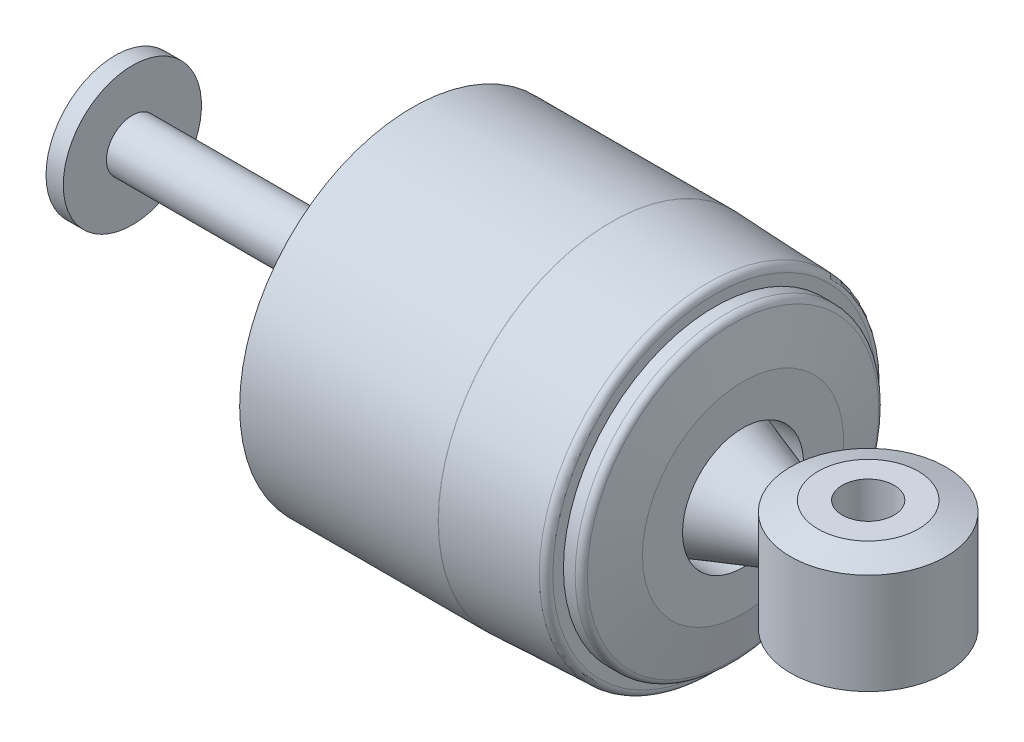
ISO-10303-21;
HEADER;
FILE_DESCRIPTION(('STEP AP214'),'2;1');
FILE_NAME('part.step','',(''),(''),'','','');
FILE_SCHEMA(('AUTOMOTIVE_DESIGN { 1 0 10303 214 1 1 1 1 }'));
ENDSEC;
DATA;
#1=APPLICATION_CONTEXT('core data for automotive mechanical design processes');
#2=APPLICATION_PROTOCOL_DEFINITION('international standard','automotive_design',2000,#1);
#3=PRODUCT_CONTEXT('',#1,'mechanical');
#4=PRODUCT('Part','Part','',(#3));
#5=PRODUCT_RELATED_PRODUCT_CATEGORY('part','',(#4));
#6=PRODUCT_DEFINITION_FORMATION('','',#4);
#7=PRODUCT_DEFINITION_CONTEXT('part definition',#1,'design');
#8=PRODUCT_DEFINITION('design','',#6,#7);
#9=PRODUCT_DEFINITION_SHAPE('','',#8);
#10=(LENGTH_UNIT() NAMED_UNIT(*) SI_UNIT(.MILLI.,.METRE.));
#11=(NAMED_UNIT(*) PLANE_ANGLE_UNIT() SI_UNIT($,.RADIAN.));
#12=(NAMED_UNIT(*) SI_UNIT($,.STERADIAN.) SOLID_ANGLE_UNIT());
#13=UNCERTAINTY_MEASURE_WITH_UNIT(LENGTH_MEASURE(1.E-05),#10,'distance_accuracy_value','');
#14=(GEOMETRIC_REPRESENTATION_CONTEXT(3) GLOBAL_UNCERTAINTY_ASSIGNED_CONTEXT((#13)) GLOBAL_UNIT_ASSIGNED_CONTEXT((#10,
#11,#12)) REPRESENTATION_CONTEXT('',''));
#15=CARTESIAN_POINT('',(0.,0.,0.));
#16=DIRECTION('',(0.,0.,1.));
#17=DIRECTION('',(1.,0.,0.));
#18=AXIS2_PLACEMENT_3D('',#15,#16,#17);
#19=CARTESIAN_POINT('',(70.4227238419156,11.1125,-7.51423949772597));
#20=DIRECTION('',(0.,1.,0.));
#21=DIRECTION('',(0.,0.,1.));
#22=AXIS2_PLACEMENT_3D('',#19,#20,#21);
#23=PLANE('',#22);
#24=CARTESIAN_POINT('',(70.4227238419156,11.1125,-7.51423949772597));
#25=DIRECTION('',(0.,1.,0.));
#26=DIRECTION('',(0.,0.,1.));
#27=AXIS2_PLACEMENT_3D('',#24,#25,#26);
#28=CIRCLE('',#27,9.20749999999995);
#29=CARTESIAN_POINT('',(70.4227238419156,11.1125,-16.7217394977259));
#30=VERTEX_POINT('',#29);
#31=EDGE_CURVE('E11',#30,#30,#28,.T.);
#32=ORIENTED_EDGE('',*,*,#31,.T.);
#33=EDGE_LOOP('',(#32));
#34=FACE_BOUND('',#33,.T.);
#35=CARTESIAN_POINT('',(70.4227238419156,11.1125,-7.51423949772597));
#36=DIRECTION('',(0.,1.,0.));
#37=DIRECTION('',(0.,0.,1.));
#38=AXIS2_PLACEMENT_3D('',#35,#36,#37);
#39=CIRCLE('',#38,4.7625);
#40=CARTESIAN_POINT('',(70.4227238419156,11.1125,-2.75173949772597));
#41=VERTEX_POINT('',#40);
#42=EDGE_CURVE('E62',#41,#41,#39,.T.);
#43=ORIENTED_EDGE('',*,*,#42,.F.);
#44=EDGE_LOOP('',(#43));
#45=FACE_BOUND('',#44,.T.);
#46=ADVANCED_FACE('F42',(#34,#45),#23,.T.);
#47=CARTESIAN_POINT('',(70.4227238419156,-11.1125,-7.51423949772596));
#48=DIRECTION('',(0.,1.,0.));
#49=DIRECTION('',(0.,0.,1.));
#50=AXIS2_PLACEMENT_3D('',#47,#48,#49);
#51=PLANE('',#50);
#52=CARTESIAN_POINT('',(70.4227238419156,-11.1125,-7.51423949772596));
#53=DIRECTION('',(0.,1.,0.));
#54=DIRECTION('',(0.,0.,1.));
#55=AXIS2_PLACEMENT_3D('',#52,#53,#54);
#56=CIRCLE('',#55,9.20749999999995);
#57=CARTESIAN_POINT('',(70.4227238419156,-11.1125,1.69326050227399));
#58=VERTEX_POINT('',#57);
#59=EDGE_CURVE('E49',#58,#58,#56,.F.);
#60=ORIENTED_EDGE('',*,*,#59,.T.);
#61=EDGE_LOOP('',(#60));
#62=FACE_BOUND('',#61,.T.);
#63=CARTESIAN_POINT('',(70.4227238419156,-11.1125,-7.51423949772596));
#64=DIRECTION('',(0.,1.,0.));
#65=DIRECTION('',(0.,0.,1.));
#66=AXIS2_PLACEMENT_3D('',#63,#64,#65);
#67=CIRCLE('',#66,4.7625);
#68=CARTESIAN_POINT('',(70.4227238419156,-11.1125,-2.75173949772596));
#69=VERTEX_POINT('',#68);
#70=EDGE_CURVE('E63',#69,#69,#67,.T.);
#71=ORIENTED_EDGE('',*,*,#70,.T.);
#72=EDGE_LOOP('',(#71));
#73=FACE_BOUND('',#72,.T.);
#74=ADVANCED_FACE('F73',(#62,#73),#51,.F.);
#75=CARTESIAN_POINT('',(70.4227238419156,11.1125,-7.51423949772597));
#76=DIRECTION('',(0.,-1.,0.));
#77=DIRECTION('',(0.,0.,-1.));
#78=AXIS2_PLACEMENT_3D('',#75,#76,#77);
#79=CYLINDRICAL_SURFACE('',#78,14.2875);
#80=CARTESIAN_POINT('',(70.4227238419156,-9.26353120992769,-7.51423949772596));
#81=DIRECTION('',(0.,1.,0.));
#82=DIRECTION('',(0.,0.,1.));
#83=AXIS2_PLACEMENT_3D('',#80,#81,#82);
#84=CIRCLE('',#83,14.2875);
#85=CARTESIAN_POINT('',(70.4227238419156,-9.26353120992769,-21.801739497726));
#86=VERTEX_POINT('',#85);
#87=EDGE_CURVE('E53',#86,#86,#84,.T.);
#88=CARTESIAN_POINT('',(70.4227238419156,9.26353120992769,-7.51423949772597));
#89=DIRECTION('',(0.,1.,0.));
#90=DIRECTION('',(0.,0.,1.));
#91=AXIS2_PLACEMENT_3D('',#88,#89,#90);
#92=CIRCLE('',#91,14.2875);
#93=CARTESIAN_POINT('',(70.4227238419156,9.26353120992769,-21.801739497726));
#94=VERTEX_POINT('',#93);
#95=EDGE_CURVE('E57',#94,#94,#92,.F.);
#96=CARTESIAN_POINT('',(70.4227238419156,-9.26353120992769,-21.801739497726));
#97=CARTESIAN_POINT('',(70.4227238419156,-9.07054097638753,-21.801739497726));
#98=CARTESIAN_POINT('',(70.4227238419156,-8.87755074284737,-21.801739497726));
#99=CARTESIAN_POINT('',(70.4227238419156,-8.49157027576705,-21.801739497726));
#100=CARTESIAN_POINT('',(70.4227238419156,-8.29858004222689,-21.801739497726));
#101=CARTESIAN_POINT('',(70.4227238419156,-7.91259957514657,-21.801739497726));
#102=CARTESIAN_POINT('',(70.4227238419156,-7.71960934160641,-21.801739497726));
#103=CARTESIAN_POINT('',(70.4227238419156,-7.33362887452609,-21.801739497726));
#104=CARTESIAN_POINT('',(70.4227238419156,-7.14063864098593,-21.801739497726));
#105=CARTESIAN_POINT('',(70.4227238419156,-6.75465817390561,-21.801739497726));
#106=CARTESIAN_POINT('',(70.4227238419156,-6.56166794036545,-21.801739497726));
#107=CARTESIAN_POINT('',(70.4227238419156,-6.17568747328513,-21.801739497726));
#108=CARTESIAN_POINT('',(70.4227238419156,-5.98269723974497,-21.801739497726));
#109=CARTESIAN_POINT('',(70.4227238419156,-5.59671677266465,-21.801739497726));
#110=CARTESIAN_POINT('',(70.4227238419156,-5.40372653912449,-21.801739497726));
#111=CARTESIAN_POINT('',(70.4227238419156,-5.01774607204417,-21.801739497726));
#112=CARTESIAN_POINT('',(70.4227238419156,-4.82475583850401,-21.801739497726));
#113=CARTESIAN_POINT('',(70.4227238419156,-4.43877537142369,-21.801739497726));
#114=CARTESIAN_POINT('',(70.4227238419156,-4.24578513788353,-21.801739497726));
#115=CARTESIAN_POINT('',(70.4227238419156,-3.85980467080321,-21.801739497726));
#116=CARTESIAN_POINT('',(70.4227238419156,-3.66681443726304,-21.801739497726));
#117=CARTESIAN_POINT('',(70.4227238419156,-3.28083397018272,-21.801739497726));
#118=CARTESIAN_POINT('',(70.4227238419156,-3.08784373664256,-21.801739497726));
#119=CARTESIAN_POINT('',(70.4227238419156,-2.70186326956224,-21.801739497726));
#120=CARTESIAN_POINT('',(70.4227238419156,-2.50887303602208,-21.801739497726));
#121=CARTESIAN_POINT('',(70.4227238419156,-2.12289256894176,-21.801739497726));
#122=CARTESIAN_POINT('',(70.4227238419156,-1.9299023354016,-21.801739497726));
#123=CARTESIAN_POINT('',(70.4227238419156,-1.54392186832128,-21.801739497726));
#124=CARTESIAN_POINT('',(70.4227238419156,-1.35093163478112,-21.801739497726));
#125=CARTESIAN_POINT('',(70.4227238419156,-0.964951167700801,-21.801739497726));
#126=CARTESIAN_POINT('',(70.4227238419156,-0.77196093416064,-21.801739497726));
#127=CARTESIAN_POINT('',(70.4227238419156,-0.38598046708032,-21.801739497726));
#128=CARTESIAN_POINT('',(70.4227238419156,-0.19299023354016,-21.801739497726));
#129=CARTESIAN_POINT('',(70.4227238419156,0.19299023354016,-21.801739497726));
#130=CARTESIAN_POINT('',(70.4227238419156,0.38598046708032,-21.801739497726));
#131=CARTESIAN_POINT('',(70.4227238419156,0.77196093416064,-21.801739497726));
#132=CARTESIAN_POINT('',(70.4227238419156,0.964951167700801,-21.801739497726));
#133=CARTESIAN_POINT('',(70.4227238419156,1.35093163478112,-21.801739497726));
#134=CARTESIAN_POINT('',(70.4227238419156,1.54392186832128,-21.801739497726));
#135=CARTESIAN_POINT('',(70.4227238419156,1.9299023354016,-21.801739497726));
#136=CARTESIAN_POINT('',(70.4227238419156,2.12289256894176,-21.801739497726));
#137=CARTESIAN_POINT('',(70.4227238419156,2.50887303602208,-21.801739497726));
#138=CARTESIAN_POINT('',(70.4227238419156,2.70186326956224,-21.801739497726));
#139=CARTESIAN_POINT('',(70.4227238419156,3.08784373664256,-21.801739497726));
#140=CARTESIAN_POINT('',(70.4227238419156,3.28083397018272,-21.801739497726));
#141=CARTESIAN_POINT('',(70.4227238419156,3.66681443726305,-21.801739497726));
#142=CARTESIAN_POINT('',(70.4227238419156,3.85980467080321,-21.801739497726));
#143=CARTESIAN_POINT('',(70.4227238419156,4.24578513788353,-21.801739497726));
#144=CARTESIAN_POINT('',(70.4227238419156,4.43877537142369,-21.801739497726));
#145=CARTESIAN_POINT('',(70.4227238419156,4.82475583850401,-21.801739497726));
#146=CARTESIAN_POINT('',(70.4227238419156,5.01774607204417,-21.801739497726));
#147=CARTESIAN_POINT('',(70.4227238419156,5.40372653912449,-21.801739497726));
#148=CARTESIAN_POINT('',(70.4227238419156,5.59671677266465,-21.801739497726));
#149=CARTESIAN_POINT('',(70.4227238419156,5.98269723974497,-21.801739497726));
#150=CARTESIAN_POINT('',(70.4227238419156,6.17568747328513,-21.801739497726));
#151=CARTESIAN_POINT('',(70.4227238419156,6.56166794036545,-21.801739497726));
#152=CARTESIAN_POINT('',(70.4227238419156,6.75465817390561,-21.801739497726));
#153=CARTESIAN_POINT('',(70.4227238419156,7.14063864098593,-21.801739497726));
#154=CARTESIAN_POINT('',(70.4227238419156,7.33362887452609,-21.801739497726));
#155=CARTESIAN_POINT('',(70.4227238419156,7.71960934160641,-21.801739497726));
#156=CARTESIAN_POINT('',(70.4227238419156,7.91259957514657,-21.801739497726));
#157=CARTESIAN_POINT('',(70.4227238419156,8.29858004222689,-21.801739497726));
#158=CARTESIAN_POINT('',(70.4227238419156,8.49157027576705,-21.801739497726));
#159=CARTESIAN_POINT('',(70.4227238419156,8.87755074284737,-21.801739497726));
#160=CARTESIAN_POINT('',(70.4227238419156,9.07054097638753,-21.801739497726));
#161=CARTESIAN_POINT('',(70.4227238419156,9.26353120992769,-21.801739497726));
#162=B_SPLINE_CURVE_WITH_KNOTS('',3,(#96,#97,#98,#99,#100,#101,#102,#103,#104,#105,#106,#107,
#108,#109,#110,#111,#112,#113,#114,#115,#116,#117,#118,#119,#120,#121,#122,#123,#124,#125,#126,
#127,#128,#129,#130,#131,#132,#133,#134,#135,#136,#137,#138,#139,#140,#141,#142,#143,#144,#145,
#146,#147,#148,#149,#150,#151,#152,#153,#154,#155,#156,#157,#158,#159,#160,#161),.UNSPECIFIED.,
.F.,.F.,(4,2,2,2,2,2,2,2,2,2,2,2,2,2,2,2,2,2,2,2,2,2,2,2,2,2,2,2,2,2,2,2,4),(0.,
0.57897070062048,1.15794140124096,1.73691210186144,2.31588280248192,2.8948535031024,
3.47382420372289,4.05279490434337,4.63176560496385,5.21073630558433,5.78970700620481,
6.36867770682529,6.94764840744577,7.52661910806625,8.10558980868673,8.68456050930721,
9.26353120992769,9.84250191054817,10.4214726111687,11.0004433117891,11.5794140124096,
12.1583847130301,12.7373554136506,13.3163261142711,13.8952968148915,14.474267515512,
15.0532382161325,15.632208916753,16.2111796173735,16.7901503179939,17.3691210186144,
17.9480917192349,18.5270624198554),.UNSPECIFIED.);
#163=EDGE_CURVE('BSEAM78',#86,#94,#162,.T.);
#164=ORIENTED_EDGE('',*,*,#87,.T.);
#165=ORIENTED_EDGE('',*,*,#95,.T.);
#166=ORIENTED_EDGE('',*,*,#163,.T.);
#167=ORIENTED_EDGE('',*,*,#163,.F.);
#168=EDGE_LOOP('',(#164,#166,#165,#167));
#169=FACE_BOUND('',#168,.T.);
#170=ADVANCED_FACE('F78',(#169),#79,.T.);
#171=CARTESIAN_POINT('',(70.4227238419156,11.1125,-7.51423949772597));
#172=DIRECTION('',(0.,-1.,0.));
#173=DIRECTION('',(0.,0.,-1.));
#174=AXIS2_PLACEMENT_3D('',#171,#172,#173);
#175=CYLINDRICAL_SURFACE('',#174,4.7625);
#176=ORIENTED_EDGE('',*,*,#42,.T.);
#177=EDGE_LOOP('',(#176));
#178=FACE_BOUND('',#177,.T.);
#179=ORIENTED_EDGE('',*,*,#70,.F.);
#180=EDGE_LOOP('',(#179));
#181=FACE_BOUND('',#180,.T.);
#182=ADVANCED_FACE('F69',(#178,#181),#175,.F.);
#183=CARTESIAN_POINT('',(70.4227238419156,-9.26353120992769,-7.51423949772596));
#184=DIRECTION('',(0.,1.,0.));
#185=DIRECTION('',(0.,0.,1.));
#186=AXIS2_PLACEMENT_3D('',#183,#184,#185);
#187=CONICAL_SURFACE('',#186,14.2875,1.22173047639603);
#188=ORIENTED_EDGE('',*,*,#59,.F.);
#189=EDGE_LOOP('',(#188));
#190=FACE_BOUND('',#189,.T.);
#191=ORIENTED_EDGE('',*,*,#87,.F.);
#192=EDGE_LOOP('',(#191));
#193=FACE_BOUND('',#192,.T.);
#194=ADVANCED_FACE('F84',(#190,#193),#187,.T.);
#195=CARTESIAN_POINT('',(70.4227238419156,11.1125,-7.51423949772597));
#196=DIRECTION('',(0.,-1.,0.));
#197=DIRECTION('',(0.,0.,-1.));
#198=AXIS2_PLACEMENT_3D('',#195,#196,#197);
#199=CONICAL_SURFACE('',#198,9.20749999999995,1.22173047639603);
#200=CARTESIAN_POINT('',(70.4227238419156,9.26353120992769,-21.801739497726));
#201=CARTESIAN_POINT('',(70.4227238419156,9.28279130149095,-21.7488228310593));
#202=CARTESIAN_POINT('',(70.4227238419156,9.3020513930542,-21.6959061643926));
#203=CARTESIAN_POINT('',(70.4227238419156,9.34057157618071,-21.5900728310593));
#204=CARTESIAN_POINT('',(70.4227238419156,9.35983166774396,-21.5371561643926));
#205=CARTESIAN_POINT('',(70.4227238419156,9.39835185087047,-21.4313228310593));
#206=CARTESIAN_POINT('',(70.4227238419156,9.41761194243372,-21.3784061643926));
#207=CARTESIAN_POINT('',(70.4227238419156,9.45613212556022,-21.2725728310593));
#208=CARTESIAN_POINT('',(70.4227238419156,9.47539221712348,-21.2196561643926));
#209=CARTESIAN_POINT('',(70.4227238419156,9.51391240024999,-21.1138228310593));
#210=CARTESIAN_POINT('',(70.4227238419156,9.53317249181324,-21.0609061643926));
#211=CARTESIAN_POINT('',(70.4227238419156,9.57169267493974,-20.9550728310593));
#212=CARTESIAN_POINT('',(70.4227238419156,9.590952766503,-20.9021561643926));
#213=CARTESIAN_POINT('',(70.4227238419156,9.6294729496295,-20.7963228310593));
#214=CARTESIAN_POINT('',(70.4227238419156,9.64873304119276,-20.7434061643926));
#215=CARTESIAN_POINT('',(70.4227238419156,9.68725322431926,-20.6375728310593));
#216=CARTESIAN_POINT('',(70.4227238419156,9.70651331588252,-20.5846561643926));
#217=CARTESIAN_POINT('',(70.4227238419156,9.74503349900902,-20.4788228310593));
#218=CARTESIAN_POINT('',(70.4227238419156,9.76429359057228,-20.4259061643926));
#219=CARTESIAN_POINT('',(70.4227238419156,9.80281377369878,-20.3200728310593));
#220=CARTESIAN_POINT('',(70.4227238419156,9.82207386526203,-20.2671561643926));
#221=CARTESIAN_POINT('',(70.4227238419156,9.86059404838854,-20.1613228310593));
#222=CARTESIAN_POINT('',(70.4227238419156,9.87985413995179,-20.1084061643926));
#223=CARTESIAN_POINT('',(70.4227238419156,9.9183743230783,-20.0025728310593));
#224=CARTESIAN_POINT('',(70.4227238419156,9.93763441464155,-19.9496561643926));
#225=CARTESIAN_POINT('',(70.4227238419156,9.97615459776806,-19.8438228310593));
#226=CARTESIAN_POINT('',(70.4227238419156,9.99541468933131,-19.7909061643926));
#227=CARTESIAN_POINT('',(70.4227238419156,10.0339348724578,-19.6850728310593));
#228=CARTESIAN_POINT('',(70.4227238419156,10.0531949640211,-19.6321561643926));
#229=CARTESIAN_POINT('',(70.4227238419156,10.0917151471476,-19.5263228310593));
#230=CARTESIAN_POINT('',(70.4227238419156,10.1109752387108,-19.4734061643926));
#231=CARTESIAN_POINT('',(70.4227238419156,10.1494954218373,-19.3675728310593));
#232=CARTESIAN_POINT('',(70.4227238419156,10.1687555134006,-19.3146561643926));
#233=CARTESIAN_POINT('',(70.4227238419156,10.2072756965271,-19.2088228310593));
#234=CARTESIAN_POINT('',(70.4227238419156,10.2265357880904,-19.1559061643926));
#235=CARTESIAN_POINT('',(70.4227238419156,10.2650559712169,-19.0500728310593));
#236=CARTESIAN_POINT('',(70.4227238419156,10.2843160627801,-18.9971561643926));
#237=CARTESIAN_POINT('',(70.4227238419156,10.3228362459066,-18.8913228310593));
#238=CARTESIAN_POINT('',(70.4227238419156,10.3420963374699,-18.8384061643926));
#239=CARTESIAN_POINT('',(70.4227238419156,10.3806165205964,-18.7325728310593));
#240=CARTESIAN_POINT('',(70.4227238419156,10.3998766121596,-18.6796561643926));
#241=CARTESIAN_POINT('',(70.4227238419156,10.4383967952861,-18.5738228310593));
#242=CARTESIAN_POINT('',(70.4227238419156,10.4576568868494,-18.5209061643926));
#243=CARTESIAN_POINT('',(70.4227238419156,10.4961770699759,-18.4150728310593));
#244=CARTESIAN_POINT('',(70.4227238419156,10.5154371615391,-18.3621561643926));
#245=CARTESIAN_POINT('',(70.4227238419156,10.5539573446657,-18.2563228310593));
#246=CARTESIAN_POINT('',(70.4227238419156,10.5732174362289,-18.2034061643926));
#247=CARTESIAN_POINT('',(70.4227238419156,10.6117376193554,-18.0975728310593));
#248=CARTESIAN_POINT('',(70.4227238419156,10.6309977109187,-18.0446561643926));
#249=CARTESIAN_POINT('',(70.4227238419156,10.6695178940452,-17.9388228310593));
#250=CARTESIAN_POINT('',(70.4227238419156,10.6887779856084,-17.8859061643926));
#251=CARTESIAN_POINT('',(70.4227238419156,10.7272981687349,-17.7800728310593));
#252=CARTESIAN_POINT('',(70.4227238419156,10.7465582602982,-17.7271561643926));
#253=CARTESIAN_POINT('',(70.4227238419156,10.7850784434247,-17.6213228310593));
#254=CARTESIAN_POINT('',(70.4227238419156,10.8043385349879,-17.5684061643926));
#255=CARTESIAN_POINT('',(70.4227238419156,10.8428587181145,-17.4625728310593));
#256=CARTESIAN_POINT('',(70.4227238419156,10.8621188096777,-17.4096561643926));
#257=CARTESIAN_POINT('',(70.4227238419156,10.9006389928042,-17.3038228310593));
#258=CARTESIAN_POINT('',(70.4227238419156,10.9198990843675,-17.2509061643926));
#259=CARTESIAN_POINT('',(70.4227238419156,10.958419267494,-17.1450728310592));
#260=CARTESIAN_POINT('',(70.4227238419156,10.9776793590572,-17.0921561643926));
#261=CARTESIAN_POINT('',(70.4227238419156,11.0161995421837,-16.9863228310593));
#262=CARTESIAN_POINT('',(70.4227238419156,11.035459633747,-16.9334061643926));
#263=CARTESIAN_POINT('',(70.4227238419156,11.0739798168735,-16.8275728310592));
#264=CARTESIAN_POINT('',(70.4227238419156,11.0932399084367,-16.7746561643926));
#265=CARTESIAN_POINT('',(70.4227238419156,11.1125,-16.7217394977259));
#266=B_SPLINE_CURVE_WITH_KNOTS('',3,(#200,#201,#202,#203,#204,#205,#206,#207,#208,#209,#210,
#211,#212,#213,#214,#215,#216,#217,#218,#219,#220,#221,#222,#223,#224,#225,#226,#227,#228,#229,
#230,#231,#232,#233,#234,#235,#236,#237,#238,#239,#240,#241,#242,#243,#244,#245,#246,#247,#248,
#249,#250,#251,#252,#253,#254,#255,#256,#257,#258,#259,#260,#261,#262,#263,#264,#265),
.UNSPECIFIED.,.F.,.F.,(4,2,2,2,2,2,2,2,2,2,2,2,2,2,2,2,2,2,2,2,2,2,2,2,2,2,2,2,2,2,2,2,4),(0.,
0.16893822138055,0.337876442761103,0.506814664141654,0.675752885522211,0.844691106902761,
1.01362932828331,1.18256754966386,1.35150577104442,1.52044399242497,1.68938221380552,
1.85832043518607,2.02725865656663,2.19619687794718,2.36513509932773,2.53407332070828,
2.70301154208883,2.87194976346939,3.04088798484994,3.20982620623049,3.37876442761104,
3.54770264899159,3.71664087037214,3.8855790917527,4.05451731313325,4.2234555345138,
4.39239375589435,4.5613319772749,4.73027019865546,4.89920842003601,5.06814664141656,
5.23708486279711,5.40602308417766),.UNSPECIFIED.);
#267=EDGE_CURVE('BSEAM44',#94,#30,#266,.T.);
#268=ORIENTED_EDGE('',*,*,#95,.F.);
#269=ORIENTED_EDGE('',*,*,#31,.F.);
#270=ORIENTED_EDGE('',*,*,#267,.T.);
#271=ORIENTED_EDGE('',*,*,#267,.F.);
#272=EDGE_LOOP('',(#268,#270,#269,#271));
#273=FACE_BOUND('',#272,.T.);
#274=ADVANCED_FACE('F44',(#273),#199,.T.);
#275=CLOSED_SHELL('',(#46,#74,#170,#182,#194,#274));
#276=MANIFOLD_SOLID_BREP('B2',#275);
#277=CARTESIAN_POINT('',(-68.0072761580845,0.,-7.51423949772596));
#278=DIRECTION('',(-1.,0.,0.));
#279=DIRECTION('',(0.,0.,1.));
#280=AXIS2_PLACEMENT_3D('',#277,#278,#279);
#281=CYLINDRICAL_SURFACE('',#280,4.7625);
#282=CARTESIAN_POINT('',(-64.8322761580845,0.,-7.51423949772596));
#283=DIRECTION('',(-1.,0.,0.));
#284=DIRECTION('',(0.,0.,1.));
#285=AXIS2_PLACEMENT_3D('',#282,#283,#284);
#286=CIRCLE('',#285,4.7625);
#287=CARTESIAN_POINT('',(-64.8322761580845,0.,-2.75173949772596));
#288=VERTEX_POINT('',#287);
#289=EDGE_CURVE('E169',#288,#288,#286,.T.);
#290=ORIENTED_EDGE('',*,*,#289,.F.);
#291=EDGE_LOOP('',(#290));
#292=FACE_BOUND('',#291,.T.);
#293=CARTESIAN_POINT('',(41.0539738419156,0.,-7.51423949772596));
#294=DIRECTION('',(-1.,0.,0.));
#295=DIRECTION('',(0.,0.,1.));
#296=AXIS2_PLACEMENT_3D('',#293,#294,#295);
#297=CIRCLE('',#296,4.7625);
#298=CARTESIAN_POINT('',(41.0539738419156,0.,-2.75173949772596));
#299=VERTEX_POINT('',#298);
#300=EDGE_CURVE('E202',#299,#299,#297,.T.);
#301=ORIENTED_EDGE('',*,*,#300,.T.);
#302=EDGE_LOOP('',(#301));
#303=FACE_BOUND('',#302,.T.);
#304=ADVANCED_FACE('F137',(#292,#303),#281,.T.);
#305=CARTESIAN_POINT('',(-68.0072761580845,0.,-7.51423949772595));
#306=DIRECTION('',(-1.,0.,0.));
#307=DIRECTION('',(0.,0.,1.));
#308=AXIS2_PLACEMENT_3D('',#305,#306,#307);
#309=PLANE('',#308);
#310=CARTESIAN_POINT('',(-68.0072761580845,0.,-7.51423949772596));
#311=DIRECTION('',(-1.,0.,0.));
#312=DIRECTION('',(0.,0.,1.));
#313=AXIS2_PLACEMENT_3D('',#310,#311,#312);
#314=CIRCLE('',#313,12.7);
#315=CARTESIAN_POINT('',(-68.0072761580845,0.,5.18576050227404));
#316=VERTEX_POINT('',#315);
#317=EDGE_CURVE('E175',#316,#316,#314,.T.);
#318=ORIENTED_EDGE('',*,*,#317,.T.);
#319=EDGE_LOOP('',(#318));
#320=FACE_BOUND('',#319,.T.);
#321=ADVANCED_FACE('F250',(#320),#309,.T.);
#322=CARTESIAN_POINT('',(-64.8322761580845,0.,-7.51423949772596));
#323=DIRECTION('',(1.,0.,0.));
#324=DIRECTION('',(0.,0.,-1.));
#325=AXIS2_PLACEMENT_3D('',#322,#323,#324);
#326=PLANE('',#325);
#327=ORIENTED_EDGE('',*,*,#289,.T.);
#328=EDGE_LOOP('',(#327));
#329=FACE_BOUND('',#328,.T.);
#330=CARTESIAN_POINT('',(-64.8322761580845,0.,-7.51423949772596));
#331=DIRECTION('',(-1.,0.,0.));
#332=DIRECTION('',(0.,0.,1.));
#333=AXIS2_PLACEMENT_3D('',#330,#331,#332);
#334=CIRCLE('',#333,12.7);
#335=CARTESIAN_POINT('',(-64.8322761580845,0.,5.18576050227404));
#336=VERTEX_POINT('',#335);
#337=EDGE_CURVE('E172',#336,#336,#334,.T.);
#338=ORIENTED_EDGE('',*,*,#337,.F.);
#339=EDGE_LOOP('',(#338));
#340=FACE_BOUND('',#339,.T.);
#341=ADVANCED_FACE('F256',(#329,#340),#326,.T.);
#342=CARTESIAN_POINT('',(-68.0072761580845,0.,-7.51423949772596));
#343=DIRECTION('',(-1.,0.,0.));
#344=DIRECTION('',(0.,0.,1.));
#345=AXIS2_PLACEMENT_3D('',#342,#343,#344);
#346=CYLINDRICAL_SURFACE('',#345,12.7);
#347=ORIENTED_EDGE('',*,*,#337,.T.);
#348=EDGE_LOOP('',(#347));
#349=FACE_BOUND('',#348,.T.);
#350=ORIENTED_EDGE('',*,*,#317,.F.);
#351=EDGE_LOOP('',(#350));
#352=FACE_BOUND('',#351,.T.);
#353=ADVANCED_FACE('F305',(#349,#352),#346,.T.);
#354=CARTESIAN_POINT('',(-68.0866511938353,0.,-7.51423949772596));
#355=DIRECTION('',(-1.,0.,0.));
#356=DIRECTION('',(0.,0.,1.));
#357=AXIS2_PLACEMENT_3D('',#354,#355,#356);
#358=CYLINDRICAL_SURFACE('',#357,11.1125);
#359=CARTESIAN_POINT('',(47.4039738419156,0.,-7.51423949772596));
#360=DIRECTION('',(-1.,0.,0.));
#361=DIRECTION('',(0.,0.,1.));
#362=AXIS2_PLACEMENT_3D('',#359,#360,#361);
#363=CIRCLE('',#362,11.1125);
#364=CARTESIAN_POINT('',(47.4039738419156,0.,3.59826050227404));
#365=VERTEX_POINT('',#364);
#366=EDGE_CURVE('E178',#365,#365,#363,.T.);
#367=ORIENTED_EDGE('',*,*,#366,.F.);
#368=EDGE_LOOP('',(#367));
#369=FACE_BOUND('',#368,.T.);
#370=CARTESIAN_POINT('',(41.8477238419155,0.,-7.51423949772596));
#371=DIRECTION('',(-1.,0.,0.));
#372=DIRECTION('',(0.,0.,1.));
#373=AXIS2_PLACEMENT_3D('',#370,#371,#372);
#374=CIRCLE('',#373,11.1125);
#375=CARTESIAN_POINT('',(41.8477238419155,0.,3.59826050227404));
#376=VERTEX_POINT('',#375);
#377=EDGE_CURVE('E166',#376,#376,#374,.T.);
#378=ORIENTED_EDGE('',*,*,#377,.T.);
#379=EDGE_LOOP('',(#378));
#380=FACE_BOUND('',#379,.T.);
#381=ADVANCED_FACE('F302',(#369,#380),#358,.F.);
#382=CARTESIAN_POINT('',(47.4039738419156,0.,-18.626739497726));
#383=DIRECTION('',(-1.,0.,0.));
#384=DIRECTION('',(0.,0.,1.));
#385=AXIS2_PLACEMENT_3D('',#382,#383,#384);
#386=PLANE('',#385);
#387=CARTESIAN_POINT('',(47.4039738419156,0.,-7.51423949772596));
#388=DIRECTION('',(-1.,0.,0.));
#389=DIRECTION('',(0.,0.,1.));
#390=AXIS2_PLACEMENT_3D('',#387,#388,#389);
#391=CIRCLE('',#390,18.4785);
#392=CARTESIAN_POINT('',(47.4039738419156,0.,10.964260502274));
#393=VERTEX_POINT('',#392);
#394=EDGE_CURVE('E181',#393,#393,#391,.T.);
#395=ORIENTED_EDGE('',*,*,#394,.F.);
#396=EDGE_LOOP('',(#395));
#397=FACE_BOUND('',#396,.T.);
#398=ORIENTED_EDGE('',*,*,#366,.T.);
#399=EDGE_LOOP('',(#398));
#400=FACE_BOUND('',#399,.T.);
#401=ADVANCED_FACE('F297',(#397,#400),#386,.F.);
#402=CARTESIAN_POINT('',(47.4039738419156,0.,-7.51423949772596));
#403=DIRECTION('',(-1.,0.,0.));
#404=DIRECTION('',(0.,0.,1.));
#405=AXIS2_PLACEMENT_3D('',#402,#403,#404);
#406=CONICAL_SURFACE('',#405,18.4785,1.35434936815079);
#407=CARTESIAN_POINT('',(45.5776645266316,0.,-7.51423949772596));
#408=DIRECTION('',(1.,0.,0.));
#409=DIRECTION('',(0.,0.,-1.));
#410=AXIS2_PLACEMENT_3D('',#407,#408,#409);
#411=CIRCLE('',#410,26.7839962781088);
#412=CARTESIAN_POINT('',(45.5776645266316,0.,-34.2982357758348));
#413=VERTEX_POINT('',#412);
#414=EDGE_CURVE('E41',#413,#413,#411,.T.);
#415=ORIENTED_EDGE('',*,*,#414,.T.);
#416=EDGE_LOOP('',(#415));
#417=FACE_BOUND('',#416,.T.);
#418=ORIENTED_EDGE('',*,*,#394,.T.);
#419=EDGE_LOOP('',(#418));
#420=FACE_BOUND('',#419,.T.);
#421=ADVANCED_FACE('F292',(#417,#420),#406,.T.);
#422=CARTESIAN_POINT('',(-68.0866511938353,0.,-7.51423949772596));
#423=DIRECTION('',(-1.,0.,0.));
#424=DIRECTION('',(0.,0.,1.));
#425=AXIS2_PLACEMENT_3D('',#422,#423,#424);
#426=CYLINDRICAL_SURFACE('',#425,27.78125);
#427=CARTESIAN_POINT('',(44.337297859965,0.,-7.51423949772598));
#428=DIRECTION('',(1.,0.,0.));
#429=DIRECTION('',(0.,0.,-1.));
#430=AXIS2_PLACEMENT_3D('',#427,#428,#429);
#431=CIRCLE('',#430,27.78125);
#432=CARTESIAN_POINT('',(44.337297859965,0.,-35.295489497726));
#433=VERTEX_POINT('',#432);
#434=EDGE_CURVE('E144',#433,#433,#431,.F.);
#435=ORIENTED_EDGE('',*,*,#434,.T.);
#436=EDGE_LOOP('',(#435));
#437=FACE_BOUND('',#436,.T.);
#438=CARTESIAN_POINT('',(42.1833767560992,0.,-7.51423949772598));
#439=DIRECTION('',(-1.,0.,0.));
#440=DIRECTION('',(0.,0.,1.));
#441=AXIS2_PLACEMENT_3D('',#438,#439,#440);
#442=CIRCLE('',#441,27.78125);
#443=CARTESIAN_POINT('',(42.1833767560992,0.,20.267010502274));
#444=VERTEX_POINT('',#443);
#445=EDGE_CURVE('E184',#444,#444,#442,.T.);
#446=ORIENTED_EDGE('',*,*,#445,.F.);
#447=EDGE_LOOP('',(#446));
#448=FACE_BOUND('',#447,.T.);
#449=ADVANCED_FACE('F287',(#437,#448),#426,.T.);
#450=CARTESIAN_POINT('',(42.1833767560992,0.,-35.2954894977259));
#451=DIRECTION('',(-1.,0.,0.));
#452=DIRECTION('',(0.,0.,1.));
#453=AXIS2_PLACEMENT_3D('',#450,#451,#452);
#454=PLANE('',#453);
#455=CARTESIAN_POINT('',(42.1833767560992,0.,-7.51423949772598));
#456=DIRECTION('',(-1.,0.,0.));
#457=DIRECTION('',(0.,0.,1.));
#458=AXIS2_PLACEMENT_3D('',#455,#456,#457);
#459=CIRCLE('',#458,29.7381087930786);
#460=CARTESIAN_POINT('',(42.1833767560992,0.,22.2238692953526));
#461=VERTEX_POINT('',#460);
#462=EDGE_CURVE('E148',#461,#461,#459,.F.);
#463=ORIENTED_EDGE('',*,*,#462,.T.);
#464=EDGE_LOOP('',(#463));
#465=FACE_BOUND('',#464,.T.);
#466=ORIENTED_EDGE('',*,*,#445,.T.);
#467=EDGE_LOOP('',(#466));
#468=FACE_BOUND('',#467,.T.);
#469=ADVANCED_FACE('F246',(#465,#468),#454,.F.);
#470=CARTESIAN_POINT('',(42.1833767560992,0.,-7.51423949772598));
#471=DIRECTION('',(-1.,0.,0.));
#472=DIRECTION('',(0.,0.,1.));
#473=AXIS2_PLACEMENT_3D('',#470,#471,#472);
#474=CONICAL_SURFACE('',#473,30.95625,0.0416787324225787);
#475=CARTESIAN_POINT('',(23.1763672376546,0.,-7.51423949772598));
#476=DIRECTION('',(1.,0.,0.));
#477=DIRECTION('',(0.,0.,-1.));
#478=AXIS2_PLACEMENT_3D('',#475,#476,#477);
#479=CIRCLE('',#478,31.7488970905432);
#480=CARTESIAN_POINT('',(23.1763672376546,0.,-39.2631365882691));
#481=VERTEX_POINT('',#480);
#482=EDGE_CURVE('E152',#481,#481,#479,.T.);
#483=ORIENTED_EDGE('',*,*,#482,.T.);
#484=EDGE_LOOP('',(#483));
#485=FACE_BOUND('',#484,.T.);
#486=CARTESIAN_POINT('',(40.9662934227659,0.,-7.51423949772599));
#487=DIRECTION('',(1.,0.,0.));
#488=DIRECTION('',(0.,0.,-1.));
#489=AXIS2_PLACEMENT_3D('',#486,#487,#488);
#490=CIRCLE('',#489,31.0070058836217);
#491=CARTESIAN_POINT('',(40.9662934227659,0.,-38.5212453813477));
#492=VERTEX_POINT('',#491);
#493=EDGE_CURVE('E157',#492,#492,#490,.F.);
#494=ORIENTED_EDGE('',*,*,#493,.T.);
#495=EDGE_LOOP('',(#494));
#496=FACE_BOUND('',#495,.T.);
#497=ADVANCED_FACE('F240',(#485,#496),#474,.T.);
#498=CARTESIAN_POINT('',(-68.0866511938353,0.,-7.51423949772596));
#499=DIRECTION('',(-1.,0.,0.));
#500=DIRECTION('',(0.,0.,1.));
#501=AXIS2_PLACEMENT_3D('',#498,#499,#500);
#502=CYLINDRICAL_SURFACE('',#501,31.75);
#503=CARTESIAN_POINT('',(23.1234505709879,0.,-7.51423949772598));
#504=DIRECTION('',(1.,0.,0.));
#505=DIRECTION('',(0.,0.,-1.));
#506=AXIS2_PLACEMENT_3D('',#503,#504,#505);
#507=CIRCLE('',#506,31.75);
#508=CARTESIAN_POINT('',(23.1234505709879,0.,-39.264239497726));
#509=VERTEX_POINT('',#508);
#510=EDGE_CURVE('E160',#509,#509,#507,.F.);
#511=ORIENTED_EDGE('',*,*,#510,.T.);
#512=EDGE_LOOP('',(#511));
#513=FACE_BOUND('',#512,.T.);
#514=CARTESIAN_POINT('',(-13.3625796020481,0.,-7.51423949772596));
#515=DIRECTION('',(-1.,0.,0.));
#516=DIRECTION('',(0.,0.,1.));
#517=AXIS2_PLACEMENT_3D('',#514,#515,#516);
#518=CIRCLE('',#517,31.75);
#519=CARTESIAN_POINT('',(-13.3625796020481,0.,24.235760502274));
#520=VERTEX_POINT('',#519);
#521=EDGE_CURVE('E187',#520,#520,#518,.T.);
#522=ORIENTED_EDGE('',*,*,#521,.F.);
#523=EDGE_LOOP('',(#522));
#524=FACE_BOUND('',#523,.T.);
#525=ADVANCED_FACE('F235',(#513,#524),#502,.T.);
#526=CARTESIAN_POINT('',(-13.3625796020481,0.,-39.264239497726));
#527=DIRECTION('',(1.,0.,0.));
#528=DIRECTION('',(0.,0.,-1.));
#529=AXIS2_PLACEMENT_3D('',#526,#527,#528);
#530=PLANE('',#529);
#531=CARTESIAN_POINT('',(-13.3625796020481,0.,-7.51423949772596));
#532=DIRECTION('',(-1.,0.,0.));
#533=DIRECTION('',(0.,0.,1.));
#534=AXIS2_PLACEMENT_3D('',#531,#532,#533);
#535=CIRCLE('',#534,30.95625);
#536=CARTESIAN_POINT('',(-13.3625796020481,0.,23.442010502274));
#537=VERTEX_POINT('',#536);
#538=EDGE_CURVE('E190',#537,#537,#535,.T.);
#539=ORIENTED_EDGE('',*,*,#538,.F.);
#540=EDGE_LOOP('',(#539));
#541=FACE_BOUND('',#540,.T.);
#542=ORIENTED_EDGE('',*,*,#521,.T.);
#543=EDGE_LOOP('',(#542));
#544=FACE_BOUND('',#543,.T.);
#545=ADVANCED_FACE('F229',(#541,#544),#530,.F.);
#546=CARTESIAN_POINT('',(-68.0866511938353,0.,-7.51423949772596));
#547=DIRECTION('',(-1.,0.,0.));
#548=DIRECTION('',(0.,0.,1.));
#549=AXIS2_PLACEMENT_3D('',#546,#547,#548);
#550=CYLINDRICAL_SURFACE('',#549,30.95625);
#551=CARTESIAN_POINT('',(23.1333767560998,0.,-7.51423949772596));
#552=DIRECTION('',(-1.,0.,0.));
#553=DIRECTION('',(0.,0.,1.));
#554=AXIS2_PLACEMENT_3D('',#551,#552,#553);
#555=CIRCLE('',#554,30.95625);
#556=CARTESIAN_POINT('',(23.1333767560998,0.,23.442010502274));
#557=VERTEX_POINT('',#556);
#558=EDGE_CURVE('E193',#557,#557,#555,.T.);
#559=ORIENTED_EDGE('',*,*,#558,.F.);
#560=EDGE_LOOP('',(#559));
#561=FACE_BOUND('',#560,.T.);
#562=ORIENTED_EDGE('',*,*,#538,.T.);
#563=EDGE_LOOP('',(#562));
#564=FACE_BOUND('',#563,.T.);
#565=ADVANCED_FACE('F223',(#561,#564),#550,.F.);
#566=CARTESIAN_POINT('',(23.1333767560998,0.,-7.51423949772596));
#567=DIRECTION('',(-1.,0.,0.));
#568=DIRECTION('',(0.,0.,1.));
#569=AXIS2_PLACEMENT_3D('',#566,#567,#568);
#570=CONICAL_SURFACE('',#569,30.95625,0.0416787324225787);
#571=CARTESIAN_POINT('',(39.6433767560992,0.,-7.51423949772598));
#572=DIRECTION('',(-1.,0.,0.));
#573=DIRECTION('',(0.,0.,1.));
#574=AXIS2_PLACEMENT_3D('',#571,#572,#573);
#575=CIRCLE('',#574,30.2677354047835);
#576=CARTESIAN_POINT('',(39.6433767560992,0.,22.7534959070576));
#577=VERTEX_POINT('',#576);
#578=EDGE_CURVE('E196',#577,#577,#575,.T.);
#579=ORIENTED_EDGE('',*,*,#578,.F.);
#580=EDGE_LOOP('',(#579));
#581=FACE_BOUND('',#580,.T.);
#582=ORIENTED_EDGE('',*,*,#558,.T.);
#583=EDGE_LOOP('',(#582));
#584=FACE_BOUND('',#583,.T.);
#585=ADVANCED_FACE('F217',(#581,#584),#570,.F.);
#586=CARTESIAN_POINT('',(39.6433767560992,0.,-7.51423949772598));
#587=DIRECTION('',(-1.,0.,0.));
#588=DIRECTION('',(0.,0.,1.));
#589=AXIS2_PLACEMENT_3D('',#586,#587,#588);
#590=CONICAL_SURFACE('',#589,30.2677354047835,1.43071325226679);
#591=CARTESIAN_POINT('',(41.0539738419156,0.,-7.51423949772596));
#592=DIRECTION('',(-1.,0.,0.));
#593=DIRECTION('',(0.,0.,1.));
#594=AXIS2_PLACEMENT_3D('',#591,#592,#593);
#595=CIRCLE('',#594,20.263970454792);
#596=CARTESIAN_POINT('',(41.0539738419156,0.,12.749730957066));
#597=VERTEX_POINT('',#596);
#598=EDGE_CURVE('E199',#597,#597,#595,.T.);
#599=ORIENTED_EDGE('',*,*,#598,.F.);
#600=EDGE_LOOP('',(#599));
#601=FACE_BOUND('',#600,.T.);
#602=ORIENTED_EDGE('',*,*,#578,.T.);
#603=EDGE_LOOP('',(#602));
#604=FACE_BOUND('',#603,.T.);
#605=ADVANCED_FACE('F211',(#601,#604),#590,.F.);
#606=CARTESIAN_POINT('',(41.0539738419156,0.,-27.7782099525179));
#607=DIRECTION('',(1.,0.,0.));
#608=DIRECTION('',(0.,0.,-1.));
#609=AXIS2_PLACEMENT_3D('',#606,#607,#608);
#610=PLANE('',#609);
#611=ORIENTED_EDGE('',*,*,#300,.F.);
#612=EDGE_LOOP('',(#611));
#613=FACE_BOUND('',#612,.T.);
#614=ORIENTED_EDGE('',*,*,#598,.T.);
#615=EDGE_LOOP('',(#614));
#616=FACE_BOUND('',#615,.T.);
#617=ADVANCED_FACE('F207',(#613,#616),#610,.F.);
#618=CARTESIAN_POINT('',(57.8497238419156,0.,-7.51423949772596));
#619=DIRECTION('',(1.,0.,0.));
#620=DIRECTION('',(0.,0.,-1.));
#621=AXIS2_PLACEMENT_3D('',#618,#619,#620);
#622=PLANE('',#621);
#623=CARTESIAN_POINT('',(57.8497238419156,0.,-7.51423949772596));
#624=DIRECTION('',(-1.,0.,0.));
#625=DIRECTION('',(0.,0.,1.));
#626=AXIS2_PLACEMENT_3D('',#623,#624,#625);
#627=CIRCLE('',#626,5.715);
#628=CARTESIAN_POINT('',(57.8497238419156,0.,-1.79923949772596));
#629=VERTEX_POINT('',#628);
#630=EDGE_CURVE('E163',#629,#629,#627,.T.);
#631=ORIENTED_EDGE('',*,*,#630,.F.);
#632=EDGE_LOOP('',(#631));
#633=FACE_BOUND('',#632,.T.);
#634=ADVANCED_FACE('F210',(#633),#622,.T.);
#635=CARTESIAN_POINT('',(41.8477238419155,0.,-7.51423949772596));
#636=DIRECTION('',(-1.,0.,0.));
#637=DIRECTION('',(0.,0.,1.));
#638=AXIS2_PLACEMENT_3D('',#635,#636,#637);
#639=CONICAL_SURFACE('',#638,11.1125,0.325317721192492);
#640=ORIENTED_EDGE('',*,*,#630,.T.);
#641=EDGE_LOOP('',(#640));
#642=FACE_BOUND('',#641,.T.);
#643=ORIENTED_EDGE('',*,*,#377,.F.);
#644=EDGE_LOOP('',(#643));
#645=FACE_BOUND('',#644,.T.);
#646=ADVANCED_FACE('F263',(#642,#645),#639,.T.);
#647=CARTESIAN_POINT('',(23.1234505709879,0.,-7.51423949772598));
#648=DIRECTION('',(1.,0.,0.));
#649=DIRECTION('',(0.,0.,-1.));
#650=AXIS2_PLACEMENT_3D('',#647,#648,#649);
#651=TOROIDAL_SURFACE('',#650,30.48,1.27);
#652=ORIENTED_EDGE('',*,*,#482,.F.);
#653=EDGE_LOOP('',(#652));
#654=FACE_BOUND('',#653,.T.);
#655=ORIENTED_EDGE('',*,*,#510,.F.);
#656=EDGE_LOOP('',(#655));
#657=FACE_BOUND('',#656,.T.);
#658=ADVANCED_FACE('F266',(#654,#657),#651,.T.);
#659=CARTESIAN_POINT('',(40.9133767560992,0.,-7.51423949772598));
#660=DIRECTION('',(-1.,0.,0.));
#661=DIRECTION('',(0.,0.,1.));
#662=AXIS2_PLACEMENT_3D('',#659,#660,#661);
#663=TOROIDAL_SURFACE('',#662,29.7381087930786,1.27);
#664=ORIENTED_EDGE('',*,*,#462,.F.);
#665=EDGE_LOOP('',(#664));
#666=FACE_BOUND('',#665,.T.);
#667=ORIENTED_EDGE('',*,*,#493,.F.);
#668=EDGE_LOOP('',(#667));
#669=FACE_BOUND('',#668,.T.);
#670=ADVANCED_FACE('F272',(#666,#669),#663,.T.);
#671=CARTESIAN_POINT('',(44.337297859965,0.,-7.51423949772598));
#672=DIRECTION('',(1.,0.,0.));
#673=DIRECTION('',(0.,0.,-1.));
#674=AXIS2_PLACEMENT_3D('',#671,#672,#673);
#675=TOROIDAL_SURFACE('',#674,26.51125,1.27);
#676=ORIENTED_EDGE('',*,*,#414,.F.);
#677=EDGE_LOOP('',(#676));
#678=FACE_BOUND('',#677,.T.);
#679=ORIENTED_EDGE('',*,*,#434,.F.);
#680=EDGE_LOOP('',(#679));
#681=FACE_BOUND('',#680,.T.);
#682=ADVANCED_FACE('F139',(#678,#681),#675,.T.);
#683=CLOSED_SHELL('',(#304,#321,#341,#353,#381,#401,#421,#449,#469,#497,#525,#545,#565,#585,
#605,#617,#634,#646,#658,#670,#682));
#684=MANIFOLD_SOLID_BREP('B6',#683);
#685=ADVANCED_BREP_SHAPE_REPRESENTATION('',(#18,#276,#684),#14);
#686=SHAPE_DEFINITION_REPRESENTATION(#9,#685);
ENDSEC;
END-ISO-10303-21;
